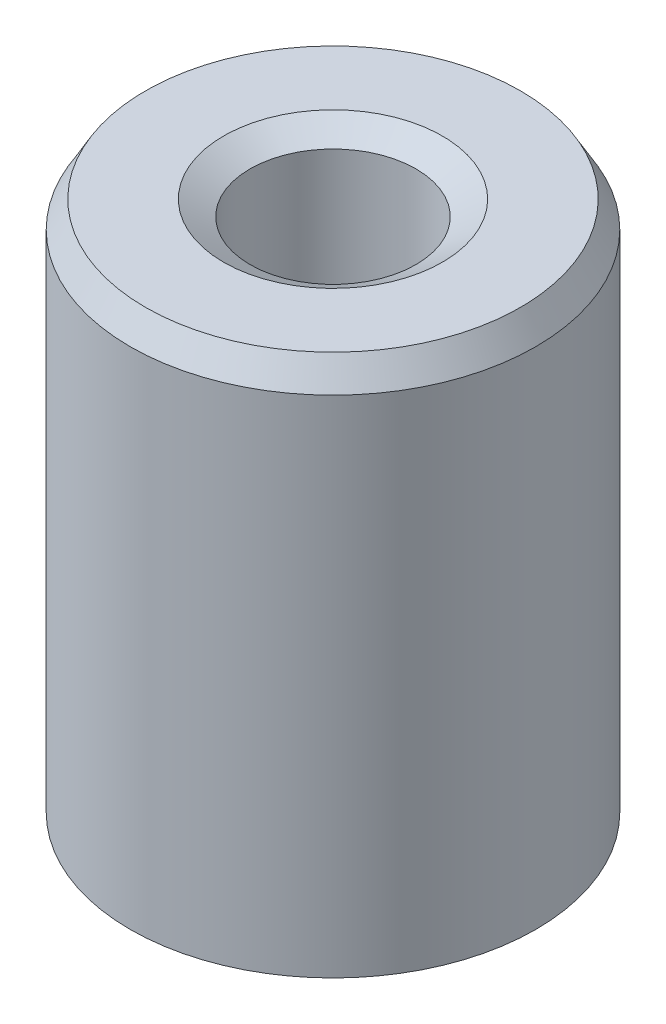
ISO-10303-21;
HEADER;
FILE_DESCRIPTION(('STEP AP214'),'2;1');
FILE_NAME('part.step','',(''),(''),'','','');
FILE_SCHEMA(('AUTOMOTIVE_DESIGN { 1 0 10303 214 1 1 1 1 }'));
ENDSEC;
DATA;
#1=APPLICATION_CONTEXT('core data for automotive mechanical design processes');
#2=APPLICATION_PROTOCOL_DEFINITION('international standard','automotive_design',2000,#1);
#3=PRODUCT_CONTEXT('',#1,'mechanical');
#4=PRODUCT('Part','Part','',(#3));
#5=PRODUCT_RELATED_PRODUCT_CATEGORY('part','',(#4));
#6=PRODUCT_DEFINITION_FORMATION('','',#4);
#7=PRODUCT_DEFINITION_CONTEXT('part definition',#1,'design');
#8=PRODUCT_DEFINITION('design','',#6,#7);
#9=PRODUCT_DEFINITION_SHAPE('','',#8);
#10=(LENGTH_UNIT() NAMED_UNIT(*) SI_UNIT(.MILLI.,.METRE.));
#11=(NAMED_UNIT(*) PLANE_ANGLE_UNIT() SI_UNIT($,.RADIAN.));
#12=(NAMED_UNIT(*) SI_UNIT($,.STERADIAN.) SOLID_ANGLE_UNIT());
#13=UNCERTAINTY_MEASURE_WITH_UNIT(LENGTH_MEASURE(1.E-05),#10,'distance_accuracy_value','');
#14=(GEOMETRIC_REPRESENTATION_CONTEXT(3) GLOBAL_UNCERTAINTY_ASSIGNED_CONTEXT((#13)) GLOBAL_UNIT_ASSIGNED_CONTEXT((#10,
#11,#12)) REPRESENTATION_CONTEXT('',''));
#15=CARTESIAN_POINT('',(0.,0.,0.));
#16=DIRECTION('',(0.,0.,1.));
#17=DIRECTION('',(1.,0.,0.));
#18=AXIS2_PLACEMENT_3D('',#15,#16,#17);
#19=CARTESIAN_POINT('',(0.,53.888614116069,0.));
#20=DIRECTION('',(0.,-1.,0.));
#21=DIRECTION('',(0.,0.,-1.));
#22=AXIS2_PLACEMENT_3D('',#19,#20,#21);
#23=CYLINDRICAL_SURFACE('',#22,20.);
#24=CARTESIAN_POINT('',(0.,1.50509842351176,0.));
#25=DIRECTION('',(0.,1.,0.));
#26=DIRECTION('',(0.,0.,1.));
#27=AXIS2_PLACEMENT_3D('',#24,#25,#26);
#28=CIRCLE('',#27,20.);
#29=CARTESIAN_POINT('',(0.,1.50509842351176,-20.));
#30=VERTEX_POINT('',#29);
#31=EDGE_CURVE('E10',#30,#30,#28,.T.);
#32=CARTESIAN_POINT('',(0.,51.2817071761549,0.));
#33=DIRECTION('',(0.,1.,0.));
#34=DIRECTION('',(0.,0.,1.));
#35=AXIS2_PLACEMENT_3D('',#32,#33,#34);
#36=CIRCLE('',#35,20.);
#37=CARTESIAN_POINT('',(0.,51.2817071761549,-20.));
#38=VERTEX_POINT('',#37);
#39=EDGE_CURVE('E50',#38,#38,#36,.F.);
#40=CARTESIAN_POINT('',(0.,1.50509842351176,-20.));
#41=CARTESIAN_POINT('',(0.,2.02360476468512,-20.));
#42=CARTESIAN_POINT('',(0.,2.54211110585849,-20.));
#43=CARTESIAN_POINT('',(0.,3.57912378820522,-20.));
#44=CARTESIAN_POINT('',(0.,4.09763012937859,-20.));
#45=CARTESIAN_POINT('',(0.,5.13464281172532,-20.));
#46=CARTESIAN_POINT('',(0.,5.65314915289869,-20.));
#47=CARTESIAN_POINT('',(0.,6.69016183524542,-20.));
#48=CARTESIAN_POINT('',(0.,7.20866817641879,-20.));
#49=CARTESIAN_POINT('',(0.,8.24568085876552,-20.));
#50=CARTESIAN_POINT('',(0.,8.76418719993888,-20.));
#51=CARTESIAN_POINT('',(0.,9.80119988228561,-20.));
#52=CARTESIAN_POINT('',(0.,10.319706223459,-20.));
#53=CARTESIAN_POINT('',(0.,11.3567189058057,-20.));
#54=CARTESIAN_POINT('',(0.,11.8752252469791,-20.));
#55=CARTESIAN_POINT('',(0.,12.9122379293258,-20.));
#56=CARTESIAN_POINT('',(0.,13.4307442704992,-20.));
#57=CARTESIAN_POINT('',(0.,14.4677569528459,-20.));
#58=CARTESIAN_POINT('',(0.,14.9862632940193,-20.));
#59=CARTESIAN_POINT('',(0.,16.023275976366,-20.));
#60=CARTESIAN_POINT('',(0.,16.5417823175394,-20.));
#61=CARTESIAN_POINT('',(0.,17.5787949998861,-20.));
#62=CARTESIAN_POINT('',(0.,18.0973013410595,-20.));
#63=CARTESIAN_POINT('',(0.,19.1343140234062,-20.));
#64=CARTESIAN_POINT('',(0.,19.6528203645796,-20.));
#65=CARTESIAN_POINT('',(0.,20.6898330469263,-20.));
#66=CARTESIAN_POINT('',(0.,21.2083393880997,-20.));
#67=CARTESIAN_POINT('',(0.,22.2453520704464,-20.));
#68=CARTESIAN_POINT('',(0.,22.7638584116198,-20.));
#69=CARTESIAN_POINT('',(0.,23.8008710939665,-20.));
#70=CARTESIAN_POINT('',(0.,24.3193774351399,-20.));
#71=CARTESIAN_POINT('',(0.,25.3563901174866,-20.));
#72=CARTESIAN_POINT('',(0.,25.87489645866,-20.));
#73=CARTESIAN_POINT('',(0.,26.9119091410067,-20.));
#74=CARTESIAN_POINT('',(0.,27.4304154821801,-20.));
#75=CARTESIAN_POINT('',(0.,28.4674281645268,-20.));
#76=CARTESIAN_POINT('',(0.,28.9859345057002,-20.));
#77=CARTESIAN_POINT('',(0.,30.0229471880469,-20.));
#78=CARTESIAN_POINT('',(0.,30.5414535292203,-20.));
#79=CARTESIAN_POINT('',(0.,31.578466211567,-20.));
#80=CARTESIAN_POINT('',(0.,32.0969725527404,-20.));
#81=CARTESIAN_POINT('',(0.,33.1339852350871,-20.));
#82=CARTESIAN_POINT('',(0.,33.6524915762605,-20.));
#83=CARTESIAN_POINT('',(0.,34.6895042586072,-20.));
#84=CARTESIAN_POINT('',(0.,35.2080105997806,-20.));
#85=CARTESIAN_POINT('',(0.,36.2450232821273,-20.));
#86=CARTESIAN_POINT('',(0.,36.7635296233006,-20.));
#87=CARTESIAN_POINT('',(0.,37.8005423056474,-20.));
#88=CARTESIAN_POINT('',(0.,38.3190486468208,-20.));
#89=CARTESIAN_POINT('',(0.,39.3560613291675,-20.));
#90=CARTESIAN_POINT('',(0.,39.8745676703408,-20.));
#91=CARTESIAN_POINT('',(0.,40.9115803526876,-20.));
#92=CARTESIAN_POINT('',(0.,41.4300866938609,-20.));
#93=CARTESIAN_POINT('',(0.,42.4670993762077,-20.));
#94=CARTESIAN_POINT('',(0.,42.985605717381,-20.));
#95=CARTESIAN_POINT('',(0.,44.0226183997278,-20.));
#96=CARTESIAN_POINT('',(0.,44.5411247409011,-20.));
#97=CARTESIAN_POINT('',(0.,45.5781374232479,-20.));
#98=CARTESIAN_POINT('',(0.,46.0966437644212,-20.));
#99=CARTESIAN_POINT('',(0.,47.133656446768,-20.));
#100=CARTESIAN_POINT('',(0.,47.6521627879413,-20.));
#101=CARTESIAN_POINT('',(0.,48.6891754702881,-20.));
#102=CARTESIAN_POINT('',(0.,49.2076818114614,-20.));
#103=CARTESIAN_POINT('',(0.,50.2446944938082,-20.));
#104=CARTESIAN_POINT('',(0.,50.7632008349815,-20.));
#105=CARTESIAN_POINT('',(0.,51.2817071761549,-20.));
#106=B_SPLINE_CURVE_WITH_KNOTS('',3,(#40,#41,#42,#43,#44,#45,#46,#47,#48,#49,#50,#51,#52,#53,
#54,#55,#56,#57,#58,#59,#60,#61,#62,#63,#64,#65,#66,#67,#68,#69,#70,#71,#72,#73,#74,#75,#76,#77,
#78,#79,#80,#81,#82,#83,#84,#85,#86,#87,#88,#89,#90,#91,#92,#93,#94,#95,#96,#97,#98,#99,#100,
#101,#102,#103,#104,#105),.UNSPECIFIED.,.F.,.F.,(4,2,2,2,2,2,2,2,2,2,2,2,2,2,2,2,2,2,2,2,2,2,2,
2,2,2,2,2,2,2,2,2,4),(0.,1.5555190235201,3.11103804704019,4.6665570705603,6.2220760940804,
7.77759511760049,9.33311414112059,10.8886331646407,12.4441521881608,13.9996712116809,
15.555190235201,17.1107092587211,18.6662282822412,20.2217473057613,21.7772663292814,
23.3327853528015,24.8883043763216,26.4438233998417,27.9993424233618,29.5548614468819,
31.110380470402,32.6658994939221,34.2214185174422,35.7769375409623,37.3324565644824,
38.8879755880024,40.4434946115226,41.9990136350427,43.5545326585627,45.1100516820828,
46.6655707056029,48.221089729123,49.7766087526431),.UNSPECIFIED.);
#107=EDGE_CURVE('BSEAM39',#30,#38,#106,.T.);
#108=ORIENTED_EDGE('',*,*,#31,.T.);
#109=ORIENTED_EDGE('',*,*,#39,.T.);
#110=ORIENTED_EDGE('',*,*,#107,.T.);
#111=ORIENTED_EDGE('',*,*,#107,.F.);
#112=EDGE_LOOP('',(#108,#110,#109,#111));
#113=FACE_BOUND('',#112,.T.);
#114=ADVANCED_FACE('F39',(#113),#23,.T.);
#115=CARTESIAN_POINT('',(0.,53.888614116069,0.));
#116=DIRECTION('',(0.,1.,0.));
#117=DIRECTION('',(0.,0.,1.));
#118=AXIS2_PLACEMENT_3D('',#115,#116,#117);
#119=PLANE('',#118);
#120=CARTESIAN_POINT('',(0.,53.888614116069,0.));
#121=DIRECTION('',(0.,1.,0.));
#122=DIRECTION('',(0.,0.,1.));
#123=AXIS2_PLACEMENT_3D('',#120,#121,#122);
#124=CIRCLE('',#123,10.7874723776404);
#125=CARTESIAN_POINT('',(0.,53.888614116069,10.7874723776404));
#126=VERTEX_POINT('',#125);
#127=EDGE_CURVE('E58',#126,#126,#124,.F.);
#128=ORIENTED_EDGE('',*,*,#127,.T.);
#129=EDGE_LOOP('',(#128));
#130=FACE_BOUND('',#129,.T.);
#131=CARTESIAN_POINT('',(0.,53.888614116069,0.));
#132=DIRECTION('',(0.,1.,0.));
#133=DIRECTION('',(0.,0.,1.));
#134=AXIS2_PLACEMENT_3D('',#131,#132,#133);
#135=CIRCLE('',#134,18.4949015764883);
#136=CARTESIAN_POINT('',(0.,53.888614116069,18.4949015764883));
#137=VERTEX_POINT('',#136);
#138=EDGE_CURVE('E61',#137,#137,#135,.T.);
#139=ORIENTED_EDGE('',*,*,#138,.T.);
#140=EDGE_LOOP('',(#139));
#141=FACE_BOUND('',#140,.T.);
#142=ADVANCED_FACE('F88',(#130,#141),#119,.T.);
#143=CARTESIAN_POINT('',(0.,0.,0.));
#144=DIRECTION('',(0.,1.,0.));
#145=DIRECTION('',(0.,0.,1.));
#146=AXIS2_PLACEMENT_3D('',#143,#144,#145);
#147=PLANE('',#146);
#148=CARTESIAN_POINT('',(0.,0.,0.));
#149=DIRECTION('',(0.,1.,0.));
#150=DIRECTION('',(0.,0.,1.));
#151=AXIS2_PLACEMENT_3D('',#148,#149,#150);
#152=CIRCLE('',#151,9.68566386123794);
#153=CARTESIAN_POINT('',(0.,0.,-9.68566386123794));
#154=VERTEX_POINT('',#153);
#155=EDGE_CURVE('E51',#154,#154,#152,.T.);
#156=ORIENTED_EDGE('',*,*,#155,.T.);
#157=EDGE_LOOP('',(#156));
#158=FACE_BOUND('',#157,.T.);
#159=CARTESIAN_POINT('',(0.,0.,0.));
#160=DIRECTION('',(0.,1.,0.));
#161=DIRECTION('',(0.,0.,1.));
#162=AXIS2_PLACEMENT_3D('',#159,#160,#161);
#163=CIRCLE('',#162,17.3930930600858);
#164=CARTESIAN_POINT('',(0.,0.,17.3930930600858));
#165=VERTEX_POINT('',#164);
#166=EDGE_CURVE('E54',#165,#165,#163,.F.);
#167=ORIENTED_EDGE('',*,*,#166,.T.);
#168=EDGE_LOOP('',(#167));
#169=FACE_BOUND('',#168,.T.);
#170=ADVANCED_FACE('F83',(#158,#169),#147,.F.);
#171=CARTESIAN_POINT('',(0.,53.888614116069,0.));
#172=DIRECTION('',(0.,-1.,0.));
#173=DIRECTION('',(0.,0.,-1.));
#174=AXIS2_PLACEMENT_3D('',#171,#172,#173);
#175=CYLINDRICAL_SURFACE('',#174,8.18056543772621);
#176=CARTESIAN_POINT('',(0.,52.3835156925573,0.));
#177=DIRECTION('',(0.,1.,0.));
#178=DIRECTION('',(0.,0.,1.));
#179=AXIS2_PLACEMENT_3D('',#176,#177,#178);
#180=CIRCLE('',#179,8.18056543772621);
#181=CARTESIAN_POINT('',(0.,52.3835156925573,-8.18056543772621));
#182=VERTEX_POINT('',#181);
#183=EDGE_CURVE('E67',#182,#182,#180,.T.);
#184=CARTESIAN_POINT('',(0.,2.60690693991418,0.));
#185=DIRECTION('',(0.,1.,0.));
#186=DIRECTION('',(0.,0.,1.));
#187=AXIS2_PLACEMENT_3D('',#184,#185,#186);
#188=CIRCLE('',#187,8.18056543772621);
#189=CARTESIAN_POINT('',(0.,2.60690693991417,-8.18056543772621));
#190=VERTEX_POINT('',#189);
#191=EDGE_CURVE('E69',#190,#190,#188,.F.);
#192=CARTESIAN_POINT('',(0.,52.3835156925573,-8.18056543772621));
#193=CARTESIAN_POINT('',(0.,51.8650093513839,-8.18056543772621));
#194=CARTESIAN_POINT('',(0.,51.3465030102105,-8.18056543772621));
#195=CARTESIAN_POINT('',(0.,50.3094903278638,-8.18056543772621));
#196=CARTESIAN_POINT('',(0.,49.7909839866904,-8.18056543772621));
#197=CARTESIAN_POINT('',(0.,48.7539713043437,-8.18056543772621));
#198=CARTESIAN_POINT('',(0.,48.2354649631704,-8.18056543772621));
#199=CARTESIAN_POINT('',(0.,47.1984522808236,-8.18056543772621));
#200=CARTESIAN_POINT('',(0.,46.6799459396502,-8.18056543772621));
#201=CARTESIAN_POINT('',(0.,45.6429332573035,-8.18056543772621));
#202=CARTESIAN_POINT('',(0.,45.1244269161302,-8.18056543772621));
#203=CARTESIAN_POINT('',(0.,44.0874142337834,-8.18056543772621));
#204=CARTESIAN_POINT('',(0.,43.56890789261,-8.18056543772621));
#205=CARTESIAN_POINT('',(0.,42.5318952102633,-8.18056543772621));
#206=CARTESIAN_POINT('',(0.,42.01338886909,-8.18056543772621));
#207=CARTESIAN_POINT('',(0.,40.9763761867432,-8.18056543772621));
#208=CARTESIAN_POINT('',(0.,40.4578698455699,-8.18056543772621));
#209=CARTESIAN_POINT('',(0.,39.4208571632231,-8.18056543772621));
#210=CARTESIAN_POINT('',(0.,38.9023508220498,-8.18056543772621));
#211=CARTESIAN_POINT('',(0.,37.865338139703,-8.18056543772621));
#212=CARTESIAN_POINT('',(0.,37.3468317985297,-8.18056543772621));
#213=CARTESIAN_POINT('',(0.,36.3098191161829,-8.18056543772621));
#214=CARTESIAN_POINT('',(0.,35.7913127750096,-8.18056543772621));
#215=CARTESIAN_POINT('',(0.,34.7543000926628,-8.18056543772621));
#216=CARTESIAN_POINT('',(0.,34.2357937514895,-8.18056543772621));
#217=CARTESIAN_POINT('',(0.,33.1987810691428,-8.18056543772621));
#218=CARTESIAN_POINT('',(0.,32.6802747279694,-8.18056543772621));
#219=CARTESIAN_POINT('',(0.,31.6432620456226,-8.18056543772621));
#220=CARTESIAN_POINT('',(0.,31.1247557044493,-8.18056543772621));
#221=CARTESIAN_POINT('',(0.,30.0877430221026,-8.18056543772621));
#222=CARTESIAN_POINT('',(0.,29.5692366809292,-8.18056543772621));
#223=CARTESIAN_POINT('',(0.,28.5322239985825,-8.18056543772621));
#224=CARTESIAN_POINT('',(0.,28.0137176574091,-8.18056543772621));
#225=CARTESIAN_POINT('',(0.,26.9767049750624,-8.18056543772621));
#226=CARTESIAN_POINT('',(0.,26.458198633889,-8.18056543772621));
#227=CARTESIAN_POINT('',(0.,25.4211859515423,-8.18056543772621));
#228=CARTESIAN_POINT('',(0.,24.9026796103689,-8.18056543772621));
#229=CARTESIAN_POINT('',(0.,23.8656669280222,-8.18056543772621));
#230=CARTESIAN_POINT('',(0.,23.3471605868488,-8.18056543772621));
#231=CARTESIAN_POINT('',(0.,22.3101479045021,-8.18056543772621));
#232=CARTESIAN_POINT('',(0.,21.7916415633287,-8.18056543772621));
#233=CARTESIAN_POINT('',(0.,20.754628880982,-8.18056543772621));
#234=CARTESIAN_POINT('',(0.,20.2361225398086,-8.18056543772621));
#235=CARTESIAN_POINT('',(0.,19.1991098574619,-8.18056543772621));
#236=CARTESIAN_POINT('',(0.,18.6806035162885,-8.18056543772621));
#237=CARTESIAN_POINT('',(0.,17.6435908339418,-8.18056543772621));
#238=CARTESIAN_POINT('',(0.,17.1250844927684,-8.18056543772621));
#239=CARTESIAN_POINT('',(0.,16.0880718104217,-8.18056543772621));
#240=CARTESIAN_POINT('',(0.,15.5695654692483,-8.18056543772621));
#241=CARTESIAN_POINT('',(0.,14.5325527869016,-8.18056543772621));
#242=CARTESIAN_POINT('',(0.,14.0140464457282,-8.18056543772621));
#243=CARTESIAN_POINT('',(0.,12.9770337633815,-8.18056543772621));
#244=CARTESIAN_POINT('',(0.,12.4585274222081,-8.18056543772621));
#245=CARTESIAN_POINT('',(0.,11.4215147398614,-8.18056543772621));
#246=CARTESIAN_POINT('',(0.,10.903008398688,-8.18056543772621));
#247=CARTESIAN_POINT('',(0.,9.86599571634129,-8.18056543772621));
#248=CARTESIAN_POINT('',(0.,9.34748937516793,-8.18056543772621));
#249=CARTESIAN_POINT('',(0.,8.3104766928212,-8.18056543772621));
#250=CARTESIAN_POINT('',(0.,7.79197035164783,-8.18056543772621));
#251=CARTESIAN_POINT('',(0.,6.7549576693011,-8.18056543772621));
#252=CARTESIAN_POINT('',(0.,6.23645132812774,-8.18056543772621));
#253=CARTESIAN_POINT('',(0.,5.19943864578101,-8.18056543772621));
#254=CARTESIAN_POINT('',(0.,4.68093230460764,-8.18056543772621));
#255=CARTESIAN_POINT('',(0.,3.6439196222609,-8.18056543772621));
#256=CARTESIAN_POINT('',(0.,3.12541328108754,-8.18056543772621));
#257=CARTESIAN_POINT('',(0.,2.60690693991417,-8.18056543772621));
#258=B_SPLINE_CURVE_WITH_KNOTS('',3,(#192,#193,#194,#195,#196,#197,#198,#199,#200,#201,#202,
#203,#204,#205,#206,#207,#208,#209,#210,#211,#212,#213,#214,#215,#216,#217,#218,#219,#220,#221,
#222,#223,#224,#225,#226,#227,#228,#229,#230,#231,#232,#233,#234,#235,#236,#237,#238,#239,#240,
#241,#242,#243,#244,#245,#246,#247,#248,#249,#250,#251,#252,#253,#254,#255,#256,#257),
.UNSPECIFIED.,.F.,.F.,(4,2,2,2,2,2,2,2,2,2,2,2,2,2,2,2,2,2,2,2,2,2,2,2,2,2,2,2,2,2,2,2,4),(0.,
1.5555190235201,3.11103804704019,4.6665570705603,6.22207609408039,7.77759511760049,
9.33311414112058,10.8886331646407,12.4441521881608,13.9996712116809,15.555190235201,
17.1107092587211,18.6662282822412,20.2217473057613,21.7772663292814,23.3327853528015,
24.8883043763215,26.4438233998416,27.9993424233617,29.5548614468818,31.1103804704019,
32.665899493922,34.2214185174421,35.7769375409622,37.3324565644823,38.8879755880024,
40.4434946115225,41.9990136350426,43.5545326585627,45.1100516820828,46.6655707056029,
48.221089729123,49.7766087526431),.UNSPECIFIED.);
#259=EDGE_CURVE('BSEAM71',#182,#190,#258,.T.);
#260=ORIENTED_EDGE('',*,*,#183,.T.);
#261=ORIENTED_EDGE('',*,*,#191,.T.);
#262=ORIENTED_EDGE('',*,*,#259,.T.);
#263=ORIENTED_EDGE('',*,*,#259,.F.);
#264=EDGE_LOOP('',(#260,#262,#261,#263));
#265=FACE_BOUND('',#264,.T.);
#266=ADVANCED_FACE('F71',(#265),#175,.F.);
#267=CARTESIAN_POINT('',(0.,52.3835156925573,0.));
#268=DIRECTION('',(0.,1.,0.));
#269=DIRECTION('',(0.,0.,1.));
#270=AXIS2_PLACEMENT_3D('',#267,#268,#269);
#271=CONICAL_SURFACE('',#270,8.18056543772621,1.0471975511966);
#272=ORIENTED_EDGE('',*,*,#127,.F.);
#273=EDGE_LOOP('',(#272));
#274=FACE_BOUND('',#273,.T.);
#275=ORIENTED_EDGE('',*,*,#183,.F.);
#276=EDGE_LOOP('',(#275));
#277=FACE_BOUND('',#276,.T.);
#278=ADVANCED_FACE('F77',(#274,#277),#271,.F.);
#279=CARTESIAN_POINT('',(0.,0.,0.));
#280=DIRECTION('',(0.,-1.,0.));
#281=DIRECTION('',(0.,0.,-1.));
#282=AXIS2_PLACEMENT_3D('',#279,#280,#281);
#283=CONICAL_SURFACE('',#282,9.68566386123794,0.523598775598292);
#284=CARTESIAN_POINT('',(0.,2.60690693991418,-8.18056543772621));
#285=CARTESIAN_POINT('',(0.,2.57975165929007,-8.19624354630446));
#286=CARTESIAN_POINT('',(0.,2.55259637866597,-8.21192165488271));
#287=CARTESIAN_POINT('',(0.,2.49828581741776,-8.2432778720392));
#288=CARTESIAN_POINT('',(0.,2.47113053679365,-8.25895598061745));
#289=CARTESIAN_POINT('',(0.,2.41681997554544,-8.29031219777394));
#290=CARTESIAN_POINT('',(0.,2.38966469492133,-8.30599030635219));
#291=CARTESIAN_POINT('',(0.,2.33535413367312,-8.33734652350869));
#292=CARTESIAN_POINT('',(0.,2.30819885304901,-8.35302463208693));
#293=CARTESIAN_POINT('',(0.,2.2538882918008,-8.38438084924343));
#294=CARTESIAN_POINT('',(0.,2.2267330111767,-8.40005895782167));
#295=CARTESIAN_POINT('',(0.,2.17242244992848,-8.43141517497817));
#296=CARTESIAN_POINT('',(0.,2.14526716930438,-8.44709328355642));
#297=CARTESIAN_POINT('',(0.,2.09095660805617,-8.47844950071291));
#298=CARTESIAN_POINT('',(0.,2.06380132743206,-8.49412760929116));
#299=CARTESIAN_POINT('',(0.,2.00949076618385,-8.52548382644765));
#300=CARTESIAN_POINT('',(0.,1.98233548555974,-8.5411619350259));
#301=CARTESIAN_POINT('',(0.,1.92802492431153,-8.57251815218239));
#302=CARTESIAN_POINT('',(0.,1.90086964368742,-8.58819626076064));
#303=CARTESIAN_POINT('',(0.,1.84655908243921,-8.61955247791714));
#304=CARTESIAN_POINT('',(0.,1.8194038018151,-8.63523058649538));
#305=CARTESIAN_POINT('',(0.,1.76509324056689,-8.66658680365188));
#306=CARTESIAN_POINT('',(0.,1.73793795994279,-8.68226491223012));
#307=CARTESIAN_POINT('',(0.,1.68362739869457,-8.71362112938662));
#308=CARTESIAN_POINT('',(0.,1.65647211807047,-8.72929923796487));
#309=CARTESIAN_POINT('',(0.,1.60216155682226,-8.76065545512136));
#310=CARTESIAN_POINT('',(0.,1.57500627619815,-8.77633356369961));
#311=CARTESIAN_POINT('',(0.,1.52069571494994,-8.8076897808561));
#312=CARTESIAN_POINT('',(0.,1.49354043432583,-8.82336788943435));
#313=CARTESIAN_POINT('',(0.,1.43922987307762,-8.85472410659084));
#314=CARTESIAN_POINT('',(0.,1.41207459245351,-8.87040221516909));
#315=CARTESIAN_POINT('',(0.,1.3577640312053,-8.90175843232558));
#316=CARTESIAN_POINT('',(0.,1.3306087505812,-8.91743654090383));
#317=CARTESIAN_POINT('',(0.,1.27629818933298,-8.94879275806033));
#318=CARTESIAN_POINT('',(0.,1.24914290870888,-8.96447086663857));
#319=CARTESIAN_POINT('',(0.,1.19483234746067,-8.99582708379507));
#320=CARTESIAN_POINT('',(0.,1.16767706683656,-9.01150519237332));
#321=CARTESIAN_POINT('',(0.,1.11336650558835,-9.04286140952981));
#322=CARTESIAN_POINT('',(0.,1.08621122496424,-9.05853951810806));
#323=CARTESIAN_POINT('',(0.,1.03190066371603,-9.08989573526455));
#324=CARTESIAN_POINT('',(0.,1.00474538309192,-9.1055738438428));
#325=CARTESIAN_POINT('',(0.,0.950434821843711,-9.13693006099929));
#326=CARTESIAN_POINT('',(0.,0.923279541219605,-9.15260816957754));
#327=CARTESIAN_POINT('',(0.,0.868968979971394,-9.18396438673403));
#328=CARTESIAN_POINT('',(0.,0.841813699347287,-9.19964249531228));
#329=CARTESIAN_POINT('',(0.,0.787503138099075,-9.23099871246878));
#330=CARTESIAN_POINT('',(0.,0.760347857474969,-9.24667682104702));
#331=CARTESIAN_POINT('',(0.,0.706037296226757,-9.27803303820352));
#332=CARTESIAN_POINT('',(0.,0.678882015602651,-9.29371114678177));
#333=CARTESIAN_POINT('',(0.,0.624571454354439,-9.32506736393826));
#334=CARTESIAN_POINT('',(0.,0.597416173730333,-9.34074547251651));
#335=CARTESIAN_POINT('',(0.,0.543105612482121,-9.372101689673));
#336=CARTESIAN_POINT('',(0.,0.515950331858015,-9.38777979825125));
#337=CARTESIAN_POINT('',(0.,0.461639770609803,-9.41913601540774));
#338=CARTESIAN_POINT('',(0.,0.434484489985697,-9.43481412398599));
#339=CARTESIAN_POINT('',(0.,0.380173928737484,-9.46617034114248));
#340=CARTESIAN_POINT('',(0.,0.353018648113378,-9.48184844972073));
#341=CARTESIAN_POINT('',(0.,0.298708086865166,-9.51320466687722));
#342=CARTESIAN_POINT('',(0.,0.27155280624106,-9.52888277545547));
#343=CARTESIAN_POINT('',(0.,0.217242244992848,-9.56023899261197));
#344=CARTESIAN_POINT('',(0.,0.190086964368742,-9.57591710119021));
#345=CARTESIAN_POINT('',(0.,0.13577640312053,-9.60727331834671));
#346=CARTESIAN_POINT('',(0.,0.108621122496424,-9.62295142692496));
#347=CARTESIAN_POINT('',(0.,0.0543105612482124,-9.65430764408145));
#348=CARTESIAN_POINT('',(0.,0.0271552806241065,-9.6699857526597));
#349=CARTESIAN_POINT('',(0.,0.,-9.68566386123794));
#350=B_SPLINE_CURVE_WITH_KNOTS('',3,(#284,#285,#286,#287,#288,#289,#290,#291,#292,#293,#294,
#295,#296,#297,#298,#299,#300,#301,#302,#303,#304,#305,#306,#307,#308,#309,#310,#311,#312,#313,
#314,#315,#316,#317,#318,#319,#320,#321,#322,#323,#324,#325,#326,#327,#328,#329,#330,#331,#332,
#333,#334,#335,#336,#337,#338,#339,#340,#341,#342,#343,#344,#345,#346,#347,#348,#349),
.UNSPECIFIED.,.F.,.F.,(4,2,2,2,2,2,2,2,2,2,2,2,2,2,2,2,2,2,2,2,2,2,2,2,2,2,2,2,2,2,2,2,4),(0.,
0.0940686514694849,0.188137302938969,0.282205954408453,0.376274605877938,0.470343257347422,
0.564411908816906,0.658480560286391,0.752549211755875,0.846617863225359,0.940686514694843,
1.03475516616433,1.12882381763381,1.2228924691033,1.31696112057278,1.41102977204226,
1.50509842351175,1.59916707498123,1.69323572645072,1.7873043779202,1.88137302938969,
1.97544168085917,2.06951033232865,2.16357898379814,2.25764763526762,2.35171628673711,
2.44578493820659,2.53985358967608,2.63392224114556,2.72799089261504,2.82205954408453,
2.91612819555401,3.0101968470235),.UNSPECIFIED.);
#351=EDGE_CURVE('BSEAM73',#190,#154,#350,.T.);
#352=ORIENTED_EDGE('',*,*,#191,.F.);
#353=ORIENTED_EDGE('',*,*,#155,.F.);
#354=ORIENTED_EDGE('',*,*,#351,.T.);
#355=ORIENTED_EDGE('',*,*,#351,.F.);
#356=EDGE_LOOP('',(#352,#354,#353,#355));
#357=FACE_BOUND('',#356,.T.);
#358=ADVANCED_FACE('F73',(#357),#283,.F.);
#359=CARTESIAN_POINT('',(0.,1.50509842351176,0.));
#360=DIRECTION('',(0.,1.,0.));
#361=DIRECTION('',(0.,0.,1.));
#362=AXIS2_PLACEMENT_3D('',#359,#360,#361);
#363=CONICAL_SURFACE('',#362,20.,1.0471975511966);
#364=ORIENTED_EDGE('',*,*,#166,.F.);
#365=EDGE_LOOP('',(#364));
#366=FACE_BOUND('',#365,.T.);
#367=ORIENTED_EDGE('',*,*,#31,.F.);
#368=EDGE_LOOP('',(#367));
#369=FACE_BOUND('',#368,.T.);
#370=ADVANCED_FACE('F76',(#366,#369),#363,.T.);
#371=CARTESIAN_POINT('',(0.,53.888614116069,0.));
#372=DIRECTION('',(0.,-1.,0.));
#373=DIRECTION('',(0.,0.,-1.));
#374=AXIS2_PLACEMENT_3D('',#371,#372,#373);
#375=CONICAL_SURFACE('',#374,18.4949015764883,0.523598775598297);
#376=ORIENTED_EDGE('',*,*,#39,.F.);
#377=EDGE_LOOP('',(#376));
#378=FACE_BOUND('',#377,.T.);
#379=ORIENTED_EDGE('',*,*,#138,.F.);
#380=EDGE_LOOP('',(#379));
#381=FACE_BOUND('',#380,.T.);
#382=ADVANCED_FACE('F45',(#378,#381),#375,.T.);
#383=CLOSED_SHELL('',(#114,#142,#170,#266,#278,#358,#370,#382));
#384=MANIFOLD_SOLID_BREP('B2',#383);
#385=ADVANCED_BREP_SHAPE_REPRESENTATION('',(#18,#384),#14);
#386=SHAPE_DEFINITION_REPRESENTATION(#9,#385);
ENDSEC;
END-ISO-10303-21;
